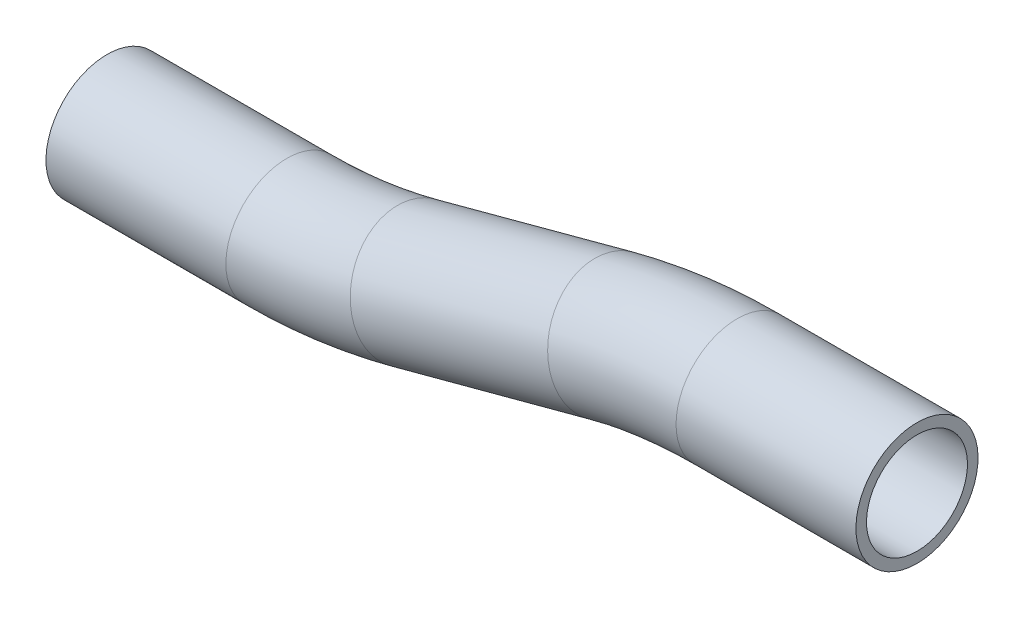
ISO-10303-21;
HEADER;
FILE_DESCRIPTION(('STEP AP214'),'2;1');
FILE_NAME('part.step','',(''),(''),'','','');
FILE_SCHEMA(('AUTOMOTIVE_DESIGN { 1 0 10303 214 1 1 1 1 }'));
ENDSEC;
DATA;
#1=APPLICATION_CONTEXT('core data for automotive mechanical design processes');
#2=APPLICATION_PROTOCOL_DEFINITION('international standard','automotive_design',2000,#1);
#3=PRODUCT_CONTEXT('',#1,'mechanical');
#4=PRODUCT('Part','Part','',(#3));
#5=PRODUCT_RELATED_PRODUCT_CATEGORY('part','',(#4));
#6=PRODUCT_DEFINITION_FORMATION('','',#4);
#7=PRODUCT_DEFINITION_CONTEXT('part definition',#1,'design');
#8=PRODUCT_DEFINITION('design','',#6,#7);
#9=PRODUCT_DEFINITION_SHAPE('','',#8);
#10=(LENGTH_UNIT() NAMED_UNIT(*) SI_UNIT(.MILLI.,.METRE.));
#11=(NAMED_UNIT(*) PLANE_ANGLE_UNIT() SI_UNIT($,.RADIAN.));
#12=(NAMED_UNIT(*) SI_UNIT($,.STERADIAN.) SOLID_ANGLE_UNIT());
#13=UNCERTAINTY_MEASURE_WITH_UNIT(LENGTH_MEASURE(1.E-05),#10,'distance_accuracy_value','');
#14=(GEOMETRIC_REPRESENTATION_CONTEXT(3) GLOBAL_UNCERTAINTY_ASSIGNED_CONTEXT((#13)) GLOBAL_UNIT_ASSIGNED_CONTEXT((#10,
#11,#12)) REPRESENTATION_CONTEXT('',''));
#15=CARTESIAN_POINT('',(0.,0.,0.));
#16=DIRECTION('',(0.,0.,1.));
#17=DIRECTION('',(1.,0.,0.));
#18=AXIS2_PLACEMENT_3D('',#15,#16,#17);
#19=CARTESIAN_POINT('',(28.0680796838404,0.,0.));
#20=DIRECTION('',(-1.,0.,0.));
#21=DIRECTION('',(0.,-1.,0.));
#22=AXIS2_PLACEMENT_3D('',#19,#20,#21);
#23=CYLINDRICAL_SURFACE('',#22,9.525);
#24=CARTESIAN_POINT('',(0.,0.,0.));
#25=DIRECTION('',(-1.,0.,0.));
#26=DIRECTION('',(0.,-1.,0.));
#27=AXIS2_PLACEMENT_3D('',#24,#25,#26);
#28=CIRCLE('',#27,9.525);
#29=CARTESIAN_POINT('',(0.,9.52499999999998,0.));
#30=VERTEX_POINT('',#29);
#31=EDGE_CURVE('E60',#30,#30,#28,.T.);
#32=ORIENTED_EDGE('',*,*,#31,.F.);
#33=EDGE_LOOP('',(#32));
#34=FACE_BOUND('',#33,.T.);
#35=CARTESIAN_POINT('',(28.0680796838404,0.,0.));
#36=DIRECTION('',(-1.,0.,0.));
#37=DIRECTION('',(0.,-1.,0.));
#38=AXIS2_PLACEMENT_3D('',#35,#36,#37);
#39=CIRCLE('',#38,9.525);
#40=CARTESIAN_POINT('',(28.0680796838404,-9.525,0.));
#41=VERTEX_POINT('',#40);
#42=EDGE_CURVE('E57',#41,#41,#39,.T.);
#43=ORIENTED_EDGE('',*,*,#42,.T.);
#44=EDGE_LOOP('',(#43));
#45=FACE_BOUND('',#44,.T.);
#46=ADVANCED_FACE('F36',(#34,#45),#23,.T.);
#47=CARTESIAN_POINT('',(0.,-76.2,0.));
#48=DIRECTION('',(0.,0.,1.));
#49=DIRECTION('',(1.,0.,0.));
#50=AXIS2_PLACEMENT_3D('',#47,#48,#49);
#51=TOROIDAL_SURFACE('',#50,76.2,9.525);
#52=CARTESIAN_POINT('',(-19.7220112368122,-2.59645203677303,0.));
#53=DIRECTION('',(-0.965925826289068,-0.258819045102522,0.));
#54=DIRECTION('',(0.258819045102522,-0.965925826289068,0.));
#55=AXIS2_PLACEMENT_3D('',#52,#53,#54);
#56=CIRCLE('',#55,9.525);
#57=CARTESIAN_POINT('',(-22.1872626414137,6.60399145863036,0.));
#58=VERTEX_POINT('',#57);
#59=EDGE_CURVE('E63',#58,#58,#56,.T.);
#60=CARTESIAN_POINT('',(0.,-76.2,0.));
#61=DIRECTION('',(0.,0.,1.));
#62=DIRECTION('',(1.,0.,0.));
#63=AXIS2_PLACEMENT_3D('',#60,#61,#62);
#64=CIRCLE('',#63,85.725);
#65=EDGE_CURVE('',#30,#58,#64,.T.);
#66=ORIENTED_EDGE('',*,*,#31,.T.);
#67=ORIENTED_EDGE('',*,*,#59,.F.);
#68=ORIENTED_EDGE('',*,*,#65,.T.);
#69=ORIENTED_EDGE('',*,*,#65,.F.);
#70=EDGE_LOOP('',(#66,#68,#67,#69));
#71=FACE_BOUND('',#70,.T.);
#72=ADVANCED_FACE('F82',(#71),#51,.T.);
#73=CARTESIAN_POINT('',(-19.7220112368122,-2.59645203677303,0.));
#74=DIRECTION('',(-0.965925826289068,-0.258819045102522,0.));
#75=DIRECTION('',(0.258819045102522,-0.965925826289068,0.));
#76=AXIS2_PLACEMENT_3D('',#73,#74,#75);
#77=CYLINDRICAL_SURFACE('',#76,9.525);
#78=CARTESIAN_POINT('',(-50.5239923613557,-10.8498180043732,0.));
#79=DIRECTION('',(-0.965925826289068,-0.258819045102522,0.));
#80=DIRECTION('',(0.258819045102522,-0.965925826289068,0.));
#81=AXIS2_PLACEMENT_3D('',#78,#79,#80);
#82=CIRCLE('',#81,9.525);
#83=CARTESIAN_POINT('',(-48.0587409567541,-20.0502614997766,0.));
#84=VERTEX_POINT('',#83);
#85=EDGE_CURVE('E65',#84,#84,#82,.T.);
#86=ORIENTED_EDGE('',*,*,#85,.F.);
#87=EDGE_LOOP('',(#86));
#88=FACE_BOUND('',#87,.T.);
#89=ORIENTED_EDGE('',*,*,#59,.T.);
#90=EDGE_LOOP('',(#89));
#91=FACE_BOUND('',#90,.T.);
#92=ADVANCED_FACE('F75',(#88,#91),#77,.T.);
#93=CARTESIAN_POINT('',(-70.2460035981678,62.7537299588538,0.));
#94=DIRECTION('',(0.,0.,-1.));
#95=DIRECTION('',(-1.,0.,0.));
#96=AXIS2_PLACEMENT_3D('',#93,#94,#95);
#97=TOROIDAL_SURFACE('',#96,76.2,9.525);
#98=CARTESIAN_POINT('',(-70.2460035981677,-13.4462700411462,0.));
#99=DIRECTION('',(-1.,0.,0.));
#100=DIRECTION('',(0.,-1.,0.));
#101=AXIS2_PLACEMENT_3D('',#98,#99,#100);
#102=CIRCLE('',#101,9.525);
#103=CARTESIAN_POINT('',(-70.2460035981677,-22.9712700411462,0.));
#104=VERTEX_POINT('',#103);
#105=EDGE_CURVE('E40',#104,#104,#102,.T.);
#106=CARTESIAN_POINT('',(-70.2460035981678,62.7537299588538,0.));
#107=DIRECTION('',(0.,0.,-1.));
#108=DIRECTION('',(-1.,0.,0.));
#109=AXIS2_PLACEMENT_3D('',#106,#107,#108);
#110=CIRCLE('',#109,85.725);
#111=EDGE_CURVE('',#84,#104,#110,.T.);
#112=ORIENTED_EDGE('',*,*,#85,.T.);
#113=ORIENTED_EDGE('',*,*,#105,.F.);
#114=ORIENTED_EDGE('',*,*,#111,.T.);
#115=ORIENTED_EDGE('',*,*,#111,.F.);
#116=EDGE_LOOP('',(#112,#114,#113,#115));
#117=FACE_BOUND('',#116,.T.);
#118=ADVANCED_FACE('F73',(#117),#97,.T.);
#119=CARTESIAN_POINT('',(-70.2460035981677,-13.4462700411462,0.));
#120=DIRECTION('',(-1.,0.,0.));
#121=DIRECTION('',(0.,-1.,0.));
#122=AXIS2_PLACEMENT_3D('',#119,#120,#121);
#123=CYLINDRICAL_SURFACE('',#122,9.525);
#124=CARTESIAN_POINT('',(-98.3140832820081,-13.4462700411462,0.));
#125=DIRECTION('',(-1.,0.,0.));
#126=DIRECTION('',(0.,-1.,0.));
#127=AXIS2_PLACEMENT_3D('',#124,#125,#126);
#128=CIRCLE('',#127,9.525);
#129=CARTESIAN_POINT('',(-98.3140832820081,-22.9712700411462,0.));
#130=VERTEX_POINT('',#129);
#131=EDGE_CURVE('E53',#130,#130,#128,.T.);
#132=ORIENTED_EDGE('',*,*,#131,.F.);
#133=EDGE_LOOP('',(#132));
#134=FACE_BOUND('',#133,.T.);
#135=ORIENTED_EDGE('',*,*,#105,.T.);
#136=EDGE_LOOP('',(#135));
#137=FACE_BOUND('',#136,.T.);
#138=ADVANCED_FACE('F38',(#134,#137),#123,.T.);
#139=CARTESIAN_POINT('',(28.0680796838404,0.,0.));
#140=DIRECTION('',(-1.,0.,0.));
#141=DIRECTION('',(0.,-1.,0.));
#142=AXIS2_PLACEMENT_3D('',#139,#140,#141);
#143=PLANE('',#142);
#144=CARTESIAN_POINT('',(28.0680796838404,0.,0.));
#145=DIRECTION('',(-1.,0.,0.));
#146=DIRECTION('',(0.,-1.,0.));
#147=AXIS2_PLACEMENT_3D('',#144,#145,#146);
#148=CIRCLE('',#147,7.874);
#149=CARTESIAN_POINT('',(28.0680796838404,-7.874,0.));
#150=VERTEX_POINT('',#149);
#151=EDGE_CURVE('E56',#150,#150,#148,.F.);
#152=ORIENTED_EDGE('',*,*,#151,.F.);
#153=EDGE_LOOP('',(#152));
#154=FACE_BOUND('',#153,.T.);
#155=ORIENTED_EDGE('',*,*,#42,.F.);
#156=EDGE_LOOP('',(#155));
#157=FACE_BOUND('',#156,.T.);
#158=ADVANCED_FACE('F80',(#154,#157),#143,.F.);
#159=CARTESIAN_POINT('',(-98.3140832820081,-13.4462700411462,0.));
#160=DIRECTION('',(-1.,0.,0.));
#161=DIRECTION('',(0.,-1.,0.));
#162=AXIS2_PLACEMENT_3D('',#159,#160,#161);
#163=PLANE('',#162);
#164=CARTESIAN_POINT('',(-98.3140832820081,-13.4462700411462,0.));
#165=DIRECTION('',(-1.,0.,0.));
#166=DIRECTION('',(0.,-1.,0.));
#167=AXIS2_PLACEMENT_3D('',#164,#165,#166);
#168=CIRCLE('',#167,7.874);
#169=CARTESIAN_POINT('',(-98.3140832820081,-21.3202700411462,0.));
#170=VERTEX_POINT('',#169);
#171=EDGE_CURVE('E10',#170,#170,#168,.F.);
#172=ORIENTED_EDGE('',*,*,#171,.T.);
#173=EDGE_LOOP('',(#172));
#174=FACE_BOUND('',#173,.T.);
#175=ORIENTED_EDGE('',*,*,#131,.T.);
#176=EDGE_LOOP('',(#175));
#177=FACE_BOUND('',#176,.T.);
#178=ADVANCED_FACE('F99',(#174,#177),#163,.T.);
#179=CARTESIAN_POINT('',(28.0680796838404,0.,0.));
#180=DIRECTION('',(-1.,0.,0.));
#181=DIRECTION('',(0.,-1.,0.));
#182=AXIS2_PLACEMENT_3D('',#179,#180,#181);
#183=CYLINDRICAL_SURFACE('',#182,7.874);
#184=CARTESIAN_POINT('',(0.,0.,0.));
#185=DIRECTION('',(-1.,0.,0.));
#186=DIRECTION('',(0.,-1.,0.));
#187=AXIS2_PLACEMENT_3D('',#184,#185,#186);
#188=CIRCLE('',#187,7.874);
#189=CARTESIAN_POINT('',(0.,7.87399999999996,0.));
#190=VERTEX_POINT('',#189);
#191=EDGE_CURVE('E197',#190,#190,#188,.F.);
#192=ORIENTED_EDGE('',*,*,#191,.F.);
#193=EDGE_LOOP('',(#192));
#194=FACE_BOUND('',#193,.T.);
#195=ORIENTED_EDGE('',*,*,#151,.T.);
#196=EDGE_LOOP('',(#195));
#197=FACE_BOUND('',#196,.T.);
#198=ADVANCED_FACE('F102',(#194,#197),#183,.F.);
#199=CARTESIAN_POINT('',(0.,-76.2,0.));
#200=DIRECTION('',(0.,0.,1.));
#201=DIRECTION('',(1.,0.,0.));
#202=AXIS2_PLACEMENT_3D('',#199,#200,#201);
#203=TOROIDAL_SURFACE('',#202,76.2,7.874);
#204=CARTESIAN_POINT('',(-19.7220112368122,-2.59645203677303,0.));
#205=DIRECTION('',(-0.965925826289068,-0.258819045102522,0.));
#206=DIRECTION('',(0.258819045102522,-0.965925826289068,0.));
#207=AXIS2_PLACEMENT_3D('',#204,#205,#206);
#208=CIRCLE('',#207,7.874);
#209=CARTESIAN_POINT('',(-21.7599523979494,5.00924791942708,0.));
#210=VERTEX_POINT('',#209);
#211=EDGE_CURVE('E196',#210,#210,#208,.F.);
#212=CARTESIAN_POINT('',(0.,-76.2,0.));
#213=DIRECTION('',(0.,0.,1.));
#214=DIRECTION('',(1.,0.,0.));
#215=AXIS2_PLACEMENT_3D('',#212,#213,#214);
#216=CIRCLE('',#215,84.074);
#217=EDGE_CURVE('',#190,#210,#216,.T.);
#218=ORIENTED_EDGE('',*,*,#191,.T.);
#219=ORIENTED_EDGE('',*,*,#211,.F.);
#220=ORIENTED_EDGE('',*,*,#217,.T.);
#221=ORIENTED_EDGE('',*,*,#217,.F.);
#222=EDGE_LOOP('',(#218,#220,#219,#221));
#223=FACE_BOUND('',#222,.T.);
#224=ADVANCED_FACE('F159',(#223),#203,.F.);
#225=CARTESIAN_POINT('',(-19.7220112368122,-2.59645203677303,0.));
#226=DIRECTION('',(-0.965925826289068,-0.258819045102522,0.));
#227=DIRECTION('',(0.258819045102522,-0.965925826289068,0.));
#228=AXIS2_PLACEMENT_3D('',#225,#226,#227);
#229=CYLINDRICAL_SURFACE('',#228,7.874);
#230=CARTESIAN_POINT('',(-50.5239923613557,-10.8498180043732,0.));
#231=DIRECTION('',(-0.965925826289068,-0.258819045102522,0.));
#232=DIRECTION('',(0.258819045102522,-0.965925826289068,0.));
#233=AXIS2_PLACEMENT_3D('',#230,#231,#232);
#234=CIRCLE('',#233,7.874);
#235=CARTESIAN_POINT('',(-48.4860512002184,-18.4555179605733,0.));
#236=VERTEX_POINT('',#235);
#237=EDGE_CURVE('E49',#236,#236,#234,.F.);
#238=ORIENTED_EDGE('',*,*,#237,.F.);
#239=EDGE_LOOP('',(#238));
#240=FACE_BOUND('',#239,.T.);
#241=ORIENTED_EDGE('',*,*,#211,.T.);
#242=EDGE_LOOP('',(#241));
#243=FACE_BOUND('',#242,.T.);
#244=ADVANCED_FACE('F93',(#240,#243),#229,.F.);
#245=CARTESIAN_POINT('',(-70.2460035981678,62.7537299588538,0.));
#246=DIRECTION('',(0.,0.,-1.));
#247=DIRECTION('',(-1.,0.,0.));
#248=AXIS2_PLACEMENT_3D('',#245,#246,#247);
#249=TOROIDAL_SURFACE('',#248,76.2,7.874);
#250=CARTESIAN_POINT('',(-70.2460035981677,-13.4462700411462,0.));
#251=DIRECTION('',(-1.,0.,0.));
#252=DIRECTION('',(0.,-1.,0.));
#253=AXIS2_PLACEMENT_3D('',#250,#251,#252);
#254=CIRCLE('',#253,7.874);
#255=CARTESIAN_POINT('',(-70.2460035981677,-21.3202700411462,0.));
#256=VERTEX_POINT('',#255);
#257=EDGE_CURVE('E44',#256,#256,#254,.F.);
#258=CARTESIAN_POINT('',(-70.2460035981678,62.7537299588538,0.));
#259=DIRECTION('',(0.,0.,-1.));
#260=DIRECTION('',(-1.,0.,0.));
#261=AXIS2_PLACEMENT_3D('',#258,#259,#260);
#262=CIRCLE('',#261,84.074);
#263=EDGE_CURVE('',#236,#256,#262,.T.);
#264=ORIENTED_EDGE('',*,*,#237,.T.);
#265=ORIENTED_EDGE('',*,*,#257,.F.);
#266=ORIENTED_EDGE('',*,*,#263,.T.);
#267=ORIENTED_EDGE('',*,*,#263,.F.);
#268=EDGE_LOOP('',(#264,#266,#265,#267));
#269=FACE_BOUND('',#268,.T.);
#270=ADVANCED_FACE('F87',(#269),#249,.F.);
#271=CARTESIAN_POINT('',(-70.2460035981677,-13.4462700411462,0.));
#272=DIRECTION('',(-1.,0.,0.));
#273=DIRECTION('',(0.,-1.,0.));
#274=AXIS2_PLACEMENT_3D('',#271,#272,#273);
#275=CYLINDRICAL_SURFACE('',#274,7.874);
#276=ORIENTED_EDGE('',*,*,#171,.F.);
#277=EDGE_LOOP('',(#276));
#278=FACE_BOUND('',#277,.T.);
#279=ORIENTED_EDGE('',*,*,#257,.T.);
#280=EDGE_LOOP('',(#279));
#281=FACE_BOUND('',#280,.T.);
#282=ADVANCED_FACE('F85',(#278,#281),#275,.F.);
#283=CLOSED_SHELL('',(#46,#72,#92,#118,#138,#158,#178,#198,#224,#244,#270,#282));
#284=MANIFOLD_SOLID_BREP('B2',#283);
#285=ADVANCED_BREP_SHAPE_REPRESENTATION('',(#18,#284),#14);
#286=SHAPE_DEFINITION_REPRESENTATION(#9,#285);
ENDSEC;
END-ISO-10303-21;
